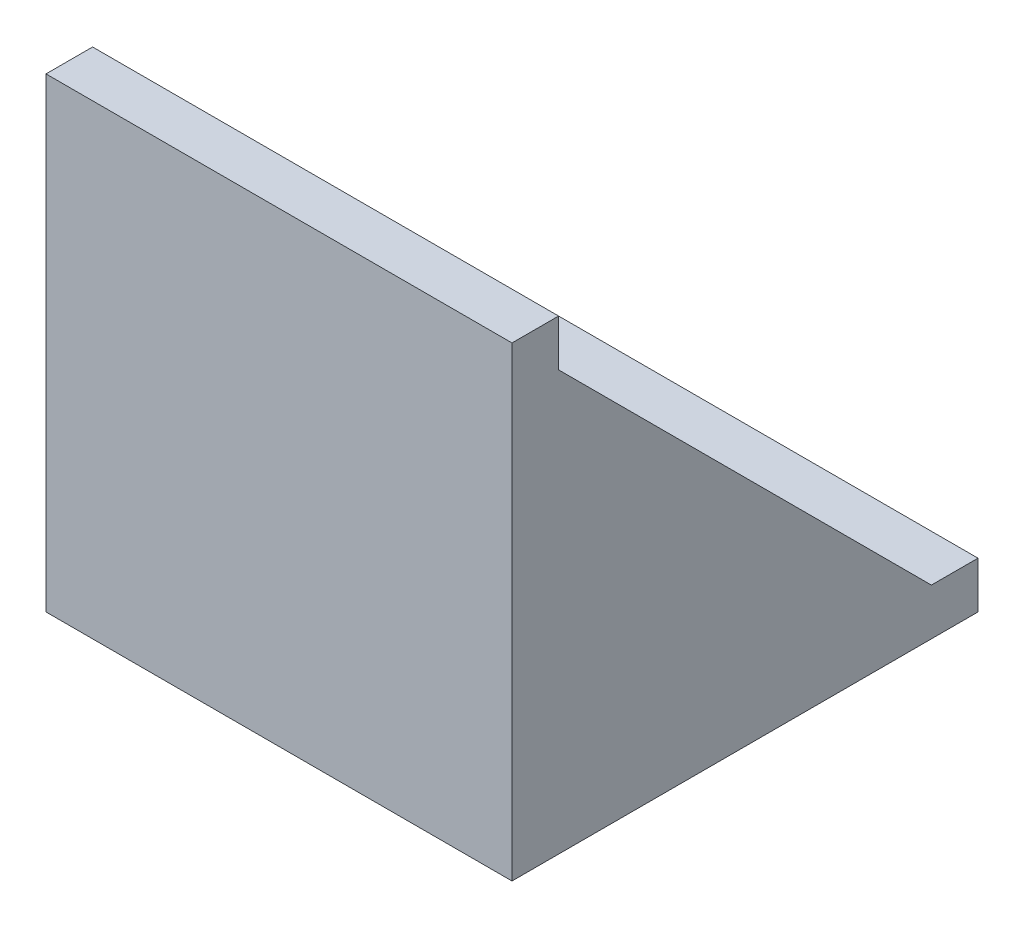
ISO-10303-21;
HEADER;
FILE_DESCRIPTION(('STEP AP214'),'2;1');
FILE_NAME('part.step','',(''),(''),'','','');
FILE_SCHEMA(('AUTOMOTIVE_DESIGN { 1 0 10303 214 1 1 1 1 }'));
ENDSEC;
DATA;
#1=APPLICATION_CONTEXT('core data for automotive mechanical design processes');
#2=APPLICATION_PROTOCOL_DEFINITION('international standard','automotive_design',2000,#1);
#3=PRODUCT_CONTEXT('',#1,'mechanical');
#4=PRODUCT('Part','Part','',(#3));
#5=PRODUCT_RELATED_PRODUCT_CATEGORY('part','',(#4));
#6=PRODUCT_DEFINITION_FORMATION('','',#4);
#7=PRODUCT_DEFINITION_CONTEXT('part definition',#1,'design');
#8=PRODUCT_DEFINITION('design','',#6,#7);
#9=PRODUCT_DEFINITION_SHAPE('','',#8);
#10=(LENGTH_UNIT() NAMED_UNIT(*) SI_UNIT(.MILLI.,.METRE.));
#11=(NAMED_UNIT(*) PLANE_ANGLE_UNIT() SI_UNIT($,.RADIAN.));
#12=(NAMED_UNIT(*) SI_UNIT($,.STERADIAN.) SOLID_ANGLE_UNIT());
#13=UNCERTAINTY_MEASURE_WITH_UNIT(LENGTH_MEASURE(1.E-05),#10,'distance_accuracy_value','');
#14=(GEOMETRIC_REPRESENTATION_CONTEXT(3) GLOBAL_UNCERTAINTY_ASSIGNED_CONTEXT((#13)) GLOBAL_UNIT_ASSIGNED_CONTEXT((#10,
#11,#12)) REPRESENTATION_CONTEXT('',''));
#15=CARTESIAN_POINT('',(0.,0.,0.));
#16=DIRECTION('',(0.,0.,1.));
#17=DIRECTION('',(1.,0.,0.));
#18=AXIS2_PLACEMENT_3D('',#15,#16,#17);
#19=CARTESIAN_POINT('',(20.,17.6554164227598,24.026925143299));
#20=DIRECTION('',(0.,-0.707106781186548,0.707106781186548));
#21=DIRECTION('',(0.,-0.707106781186548,-0.707106781186548));
#22=AXIS2_PLACEMENT_3D('',#19,#20,#21);
#23=PLANE('',#22);
#24=DIRECTION('',(-1.,0.,0.));
#25=VECTOR('',#24,1.);
#26=CARTESIAN_POINT('',(20.,1.65541642275984,8.02692514329899));
#27=LINE('',#26,#25);
#28=CARTESIAN_POINT('',(20.,1.65541642275984,8.02692514329899));
#29=VERTEX_POINT('',#28);
#30=CARTESIAN_POINT('',(19.,1.65541642275984,8.02692514329899));
#31=VERTEX_POINT('',#30);
#32=EDGE_CURVE('E121',#29,#31,#27,.T.);
#33=ORIENTED_EDGE('',*,*,#32,.T.);
#34=DIRECTION('',(0.,0.707106781186548,0.707106781186548));
#35=VECTOR('',#34,1.);
#36=CARTESIAN_POINT('',(19.,17.6554164227598,24.026925143299));
#37=LINE('',#36,#35);
#38=CARTESIAN_POINT('',(19.,17.6554164227598,24.026925143299));
#39=VERTEX_POINT('',#38);
#40=EDGE_CURVE('E11',#31,#39,#37,.T.);
#41=ORIENTED_EDGE('',*,*,#40,.T.);
#42=DIRECTION('',(-1.,0.,0.));
#43=VECTOR('',#42,1.);
#44=CARTESIAN_POINT('',(20.,17.6554164227598,24.026925143299));
#45=LINE('',#44,#43);
#46=CARTESIAN_POINT('',(20.,17.6554164227598,24.026925143299));
#47=VERTEX_POINT('',#46);
#48=EDGE_CURVE('E133',#47,#39,#45,.T.);
#49=ORIENTED_EDGE('',*,*,#48,.F.);
#50=DIRECTION('',(0.,0.707106781186548,0.707106781186548));
#51=VECTOR('',#50,1.);
#52=CARTESIAN_POINT('',(20.,17.6554164227598,24.026925143299));
#53=LINE('',#52,#51);
#54=EDGE_CURVE('E111',#29,#47,#53,.T.);
#55=ORIENTED_EDGE('',*,*,#54,.F.);
#56=EDGE_LOOP('',(#33,#41,#49,#55));
#57=FACE_BOUND('',#56,.T.);
#58=ADVANCED_FACE('F34',(#57),#23,.F.);
#59=CARTESIAN_POINT('',(20.,19.6554164227598,26.026925143299));
#60=DIRECTION('',(0.,-1.,0.));
#61=DIRECTION('',(0.,0.,-1.));
#62=AXIS2_PLACEMENT_3D('',#59,#60,#61);
#63=PLANE('',#62);
#64=DIRECTION('',(0.,0.,1.));
#65=VECTOR('',#64,1.);
#66=CARTESIAN_POINT('',(0.,19.6554164227598,26.026925143299));
#67=LINE('',#66,#65);
#68=CARTESIAN_POINT('',(0.,19.6554164227598,24.026925143299));
#69=VERTEX_POINT('',#68);
#70=CARTESIAN_POINT('',(0.,19.6554164227598,26.026925143299));
#71=VERTEX_POINT('',#70);
#72=EDGE_CURVE('E139',#69,#71,#67,.T.);
#73=ORIENTED_EDGE('',*,*,#72,.T.);
#74=DIRECTION('',(-1.,0.,0.));
#75=VECTOR('',#74,1.);
#76=CARTESIAN_POINT('',(20.,19.6554164227598,26.026925143299));
#77=LINE('',#76,#75);
#78=CARTESIAN_POINT('',(20.,19.6554164227598,26.026925143299));
#79=VERTEX_POINT('',#78);
#80=EDGE_CURVE('E166',#79,#71,#77,.T.);
#81=ORIENTED_EDGE('',*,*,#80,.F.);
#82=DIRECTION('',(0.,0.,1.));
#83=VECTOR('',#82,1.);
#84=CARTESIAN_POINT('',(20.,19.6554164227598,26.026925143299));
#85=LINE('',#84,#83);
#86=CARTESIAN_POINT('',(20.,19.6554164227598,24.026925143299));
#87=VERTEX_POINT('',#86);
#88=EDGE_CURVE('E155',#87,#79,#85,.T.);
#89=ORIENTED_EDGE('',*,*,#88,.F.);
#90=DIRECTION('',(-1.,0.,0.));
#91=VECTOR('',#90,1.);
#92=CARTESIAN_POINT('',(20.,19.6554164227598,24.026925143299));
#93=LINE('',#92,#91);
#94=EDGE_CURVE('E135',#87,#69,#93,.T.);
#95=ORIENTED_EDGE('',*,*,#94,.T.);
#96=EDGE_LOOP('',(#73,#81,#89,#95));
#97=FACE_BOUND('',#96,.T.);
#98=ADVANCED_FACE('F36',(#97),#63,.F.);
#99=CARTESIAN_POINT('',(20.,-0.344583577240157,26.026925143299));
#100=DIRECTION('',(0.,0.,-1.));
#101=DIRECTION('',(-1.,0.,0.));
#102=AXIS2_PLACEMENT_3D('',#99,#100,#101);
#103=PLANE('',#102);
#104=DIRECTION('',(0.,-1.,0.));
#105=VECTOR('',#104,1.);
#106=CARTESIAN_POINT('',(0.,-0.344583577240157,26.026925143299));
#107=LINE('',#106,#105);
#108=CARTESIAN_POINT('',(0.,-0.344583577240157,26.026925143299));
#109=VERTEX_POINT('',#108);
#110=EDGE_CURVE('E142',#71,#109,#107,.T.);
#111=ORIENTED_EDGE('',*,*,#110,.T.);
#112=DIRECTION('',(-1.,0.,0.));
#113=VECTOR('',#112,1.);
#114=CARTESIAN_POINT('',(20.,-0.344583577240157,26.026925143299));
#115=LINE('',#114,#113);
#116=CARTESIAN_POINT('',(20.,-0.344583577240157,26.026925143299));
#117=VERTEX_POINT('',#116);
#118=EDGE_CURVE('E163',#117,#109,#115,.T.);
#119=ORIENTED_EDGE('',*,*,#118,.F.);
#120=DIRECTION('',(0.,-1.,0.));
#121=VECTOR('',#120,1.);
#122=CARTESIAN_POINT('',(20.,-0.344583577240157,26.026925143299));
#123=LINE('',#122,#121);
#124=EDGE_CURVE('E94',#79,#117,#123,.T.);
#125=ORIENTED_EDGE('',*,*,#124,.F.);
#126=ORIENTED_EDGE('',*,*,#80,.T.);
#127=EDGE_LOOP('',(#111,#119,#125,#126));
#128=FACE_BOUND('',#127,.T.);
#129=ADVANCED_FACE('F220',(#128),#103,.F.);
#130=CARTESIAN_POINT('',(20.,-0.344583577240155,6.02692514329899));
#131=DIRECTION('',(0.,1.,0.));
#132=DIRECTION('',(0.,0.,1.));
#133=AXIS2_PLACEMENT_3D('',#130,#131,#132);
#134=PLANE('',#133);
#135=DIRECTION('',(0.,0.,-1.));
#136=VECTOR('',#135,1.);
#137=CARTESIAN_POINT('',(0.,-0.344583577240155,6.02692514329899));
#138=LINE('',#137,#136);
#139=CARTESIAN_POINT('',(0.,-0.344583577240155,6.02692514329899));
#140=VERTEX_POINT('',#139);
#141=EDGE_CURVE('E145',#109,#140,#138,.T.);
#142=ORIENTED_EDGE('',*,*,#141,.T.);
#143=DIRECTION('',(-1.,0.,0.));
#144=VECTOR('',#143,1.);
#145=CARTESIAN_POINT('',(20.,-0.344583577240155,6.02692514329899));
#146=LINE('',#145,#144);
#147=CARTESIAN_POINT('',(20.,-0.344583577240155,6.02692514329899));
#148=VERTEX_POINT('',#147);
#149=EDGE_CURVE('E160',#148,#140,#146,.T.);
#150=ORIENTED_EDGE('',*,*,#149,.F.);
#151=DIRECTION('',(0.,0.,-1.));
#152=VECTOR('',#151,1.);
#153=CARTESIAN_POINT('',(20.,-0.344583577240155,6.02692514329899));
#154=LINE('',#153,#152);
#155=EDGE_CURVE('E206',#117,#148,#154,.T.);
#156=ORIENTED_EDGE('',*,*,#155,.F.);
#157=ORIENTED_EDGE('',*,*,#118,.T.);
#158=EDGE_LOOP('',(#142,#150,#156,#157));
#159=FACE_BOUND('',#158,.T.);
#160=ADVANCED_FACE('F210',(#159),#134,.F.);
#161=CARTESIAN_POINT('',(20.,-0.344583577240155,6.02692514329899));
#162=DIRECTION('',(0.,0.,1.));
#163=DIRECTION('',(1.,0.,0.));
#164=AXIS2_PLACEMENT_3D('',#161,#162,#163);
#165=PLANE('',#164);
#166=DIRECTION('',(0.,1.,0.));
#167=VECTOR('',#166,1.);
#168=CARTESIAN_POINT('',(0.,-0.344583577240155,6.02692514329899));
#169=LINE('',#168,#167);
#170=CARTESIAN_POINT('',(0.,1.65541642275985,6.02692514329899));
#171=VERTEX_POINT('',#170);
#172=EDGE_CURVE('E147',#140,#171,#169,.T.);
#173=ORIENTED_EDGE('',*,*,#172,.T.);
#174=DIRECTION('',(-1.,0.,0.));
#175=VECTOR('',#174,1.);
#176=CARTESIAN_POINT('',(20.,1.65541642275985,6.02692514329899));
#177=LINE('',#176,#175);
#178=CARTESIAN_POINT('',(20.,1.65541642275985,6.02692514329899));
#179=VERTEX_POINT('',#178);
#180=EDGE_CURVE('E129',#179,#171,#177,.T.);
#181=ORIENTED_EDGE('',*,*,#180,.F.);
#182=DIRECTION('',(0.,1.,0.));
#183=VECTOR('',#182,1.);
#184=CARTESIAN_POINT('',(20.,-0.344583577240155,6.02692514329899));
#185=LINE('',#184,#183);
#186=EDGE_CURVE('E114',#148,#179,#185,.T.);
#187=ORIENTED_EDGE('',*,*,#186,.F.);
#188=ORIENTED_EDGE('',*,*,#149,.T.);
#189=EDGE_LOOP('',(#173,#181,#187,#188));
#190=FACE_BOUND('',#189,.T.);
#191=ADVANCED_FACE('F212',(#190),#165,.F.);
#192=CARTESIAN_POINT('',(20.,1.65541642275985,6.02692514329899));
#193=DIRECTION('',(0.,-1.,0.));
#194=DIRECTION('',(0.,0.,-1.));
#195=AXIS2_PLACEMENT_3D('',#192,#193,#194);
#196=PLANE('',#195);
#197=DIRECTION('',(0.,0.,1.));
#198=VECTOR('',#197,1.);
#199=CARTESIAN_POINT('',(0.,1.65541642275985,6.02692514329899));
#200=LINE('',#199,#198);
#201=CARTESIAN_POINT('',(0.,1.65541642275984,8.02692514329899));
#202=VERTEX_POINT('',#201);
#203=EDGE_CURVE('E149',#171,#202,#200,.T.);
#204=ORIENTED_EDGE('',*,*,#203,.T.);
#205=CARTESIAN_POINT('',(1.,1.65541642275984,8.02692514329899));
#206=VERTEX_POINT('',#205);
#207=EDGE_CURVE('E130',#206,#202,#27,.T.);
#208=ORIENTED_EDGE('',*,*,#207,.F.);
#209=DIRECTION('',(0.,0.,-1.));
#210=VECTOR('',#209,1.);
#211=CARTESIAN_POINT('',(1.,1.65541642275985,6.02692514329899));
#212=LINE('',#211,#210);
#213=CARTESIAN_POINT('',(1.,1.65541642275984,24.026925143299));
#214=VERTEX_POINT('',#213);
#215=EDGE_CURVE('E178',#214,#206,#212,.T.);
#216=ORIENTED_EDGE('',*,*,#215,.F.);
#217=DIRECTION('',(-1.,0.,0.));
#218=VECTOR('',#217,1.);
#219=CARTESIAN_POINT('',(20.,1.65541642275984,24.026925143299));
#220=LINE('',#219,#218);
#221=CARTESIAN_POINT('',(19.,1.65541642275984,24.026925143299));
#222=VERTEX_POINT('',#221);
#223=EDGE_CURVE('E199',#222,#214,#220,.T.);
#224=ORIENTED_EDGE('',*,*,#223,.F.);
#225=DIRECTION('',(0.,0.,1.));
#226=VECTOR('',#225,1.);
#227=CARTESIAN_POINT('',(19.,1.65541642275985,6.02692514329899));
#228=LINE('',#227,#226);
#229=EDGE_CURVE('E127',#31,#222,#228,.T.);
#230=ORIENTED_EDGE('',*,*,#229,.F.);
#231=ORIENTED_EDGE('',*,*,#32,.F.);
#232=DIRECTION('',(0.,0.,1.));
#233=VECTOR('',#232,1.);
#234=CARTESIAN_POINT('',(20.,1.65541642275985,6.02692514329899));
#235=LINE('',#234,#233);
#236=EDGE_CURVE('E107',#179,#29,#235,.T.);
#237=ORIENTED_EDGE('',*,*,#236,.F.);
#238=ORIENTED_EDGE('',*,*,#180,.T.);
#239=EDGE_LOOP('',(#204,#208,#216,#224,#230,#231,#237,#238));
#240=FACE_BOUND('',#239,.T.);
#241=ADVANCED_FACE('F123',(#240),#196,.F.);
#242=CARTESIAN_POINT('',(1.,17.6554164227598,24.026925143299));
#243=VERTEX_POINT('',#242);
#244=CARTESIAN_POINT('',(0.,17.6554164227598,24.026925143299));
#245=VERTEX_POINT('',#244);
#246=EDGE_CURVE('E157',#243,#245,#45,.T.);
#247=ORIENTED_EDGE('',*,*,#246,.F.);
#248=DIRECTION('',(0.,-0.707106781186548,-0.707106781186548));
#249=VECTOR('',#248,1.);
#250=CARTESIAN_POINT('',(1.,17.6554164227598,24.026925143299));
#251=LINE('',#250,#249);
#252=EDGE_CURVE('E42',#243,#206,#251,.T.);
#253=ORIENTED_EDGE('',*,*,#252,.T.);
#254=ORIENTED_EDGE('',*,*,#207,.T.);
#255=DIRECTION('',(0.,0.707106781186548,0.707106781186548));
#256=VECTOR('',#255,1.);
#257=CARTESIAN_POINT('',(0.,17.6554164227598,24.026925143299));
#258=LINE('',#257,#256);
#259=EDGE_CURVE('E151',#202,#245,#258,.T.);
#260=ORIENTED_EDGE('',*,*,#259,.T.);
#261=EDGE_LOOP('',(#247,#253,#254,#260));
#262=FACE_BOUND('',#261,.T.);
#263=ADVANCED_FACE('F172',(#262),#23,.F.);
#264=CARTESIAN_POINT('',(20.,17.6554164227598,24.026925143299));
#265=DIRECTION('',(0.,0.,1.));
#266=DIRECTION('',(1.,0.,0.));
#267=AXIS2_PLACEMENT_3D('',#264,#265,#266);
#268=PLANE('',#267);
#269=DIRECTION('',(0.,1.,0.));
#270=VECTOR('',#269,1.);
#271=CARTESIAN_POINT('',(0.,17.6554164227598,24.026925143299));
#272=LINE('',#271,#270);
#273=EDGE_CURVE('E85',#245,#69,#272,.T.);
#274=ORIENTED_EDGE('',*,*,#273,.T.);
#275=ORIENTED_EDGE('',*,*,#94,.F.);
#276=DIRECTION('',(0.,1.,0.));
#277=VECTOR('',#276,1.);
#278=CARTESIAN_POINT('',(20.,17.6554164227598,24.026925143299));
#279=LINE('',#278,#277);
#280=EDGE_CURVE('E58',#47,#87,#279,.T.);
#281=ORIENTED_EDGE('',*,*,#280,.F.);
#282=ORIENTED_EDGE('',*,*,#48,.T.);
#283=DIRECTION('',(0.,-1.,0.));
#284=VECTOR('',#283,1.);
#285=CARTESIAN_POINT('',(19.,17.6554164227598,24.026925143299));
#286=LINE('',#285,#284);
#287=EDGE_CURVE('E143',#39,#222,#286,.T.);
#288=ORIENTED_EDGE('',*,*,#287,.T.);
#289=ORIENTED_EDGE('',*,*,#223,.T.);
#290=DIRECTION('',(0.,-1.,0.));
#291=VECTOR('',#290,1.);
#292=CARTESIAN_POINT('',(1.,17.6554164227598,24.026925143299));
#293=LINE('',#292,#291);
#294=EDGE_CURVE('E49',#243,#214,#293,.T.);
#295=ORIENTED_EDGE('',*,*,#294,.F.);
#296=ORIENTED_EDGE('',*,*,#246,.T.);
#297=EDGE_LOOP('',(#274,#275,#281,#282,#288,#289,#295,#296));
#298=FACE_BOUND('',#297,.T.);
#299=ADVANCED_FACE('F189',(#298),#268,.F.);
#300=CARTESIAN_POINT('',(20.,0.,0.));
#301=DIRECTION('',(1.,0.,0.));
#302=DIRECTION('',(0.,0.,-1.));
#303=AXIS2_PLACEMENT_3D('',#300,#301,#302);
#304=PLANE('',#303);
#305=ORIENTED_EDGE('',*,*,#88,.T.);
#306=ORIENTED_EDGE('',*,*,#124,.T.);
#307=ORIENTED_EDGE('',*,*,#155,.T.);
#308=ORIENTED_EDGE('',*,*,#186,.T.);
#309=ORIENTED_EDGE('',*,*,#236,.T.);
#310=ORIENTED_EDGE('',*,*,#54,.T.);
#311=ORIENTED_EDGE('',*,*,#280,.T.);
#312=EDGE_LOOP('',(#305,#306,#307,#308,#309,#310,#311));
#313=FACE_BOUND('',#312,.T.);
#314=ADVANCED_FACE('F109',(#313),#304,.T.);
#315=CARTESIAN_POINT('',(0.,0.,0.));
#316=DIRECTION('',(1.,0.,0.));
#317=DIRECTION('',(0.,0.,-1.));
#318=AXIS2_PLACEMENT_3D('',#315,#316,#317);
#319=PLANE('',#318);
#320=ORIENTED_EDGE('',*,*,#72,.F.);
#321=ORIENTED_EDGE('',*,*,#273,.F.);
#322=ORIENTED_EDGE('',*,*,#259,.F.);
#323=ORIENTED_EDGE('',*,*,#203,.F.);
#324=ORIENTED_EDGE('',*,*,#172,.F.);
#325=ORIENTED_EDGE('',*,*,#141,.F.);
#326=ORIENTED_EDGE('',*,*,#110,.F.);
#327=EDGE_LOOP('',(#320,#321,#322,#323,#324,#325,#326));
#328=FACE_BOUND('',#327,.T.);
#329=ADVANCED_FACE('F184',(#328),#319,.F.);
#330=CARTESIAN_POINT('',(19.,17.6554164227598,6.02692514329899));
#331=DIRECTION('',(1.,0.,0.));
#332=DIRECTION('',(0.,0.,-1.));
#333=AXIS2_PLACEMENT_3D('',#330,#331,#332);
#334=PLANE('',#333);
#335=ORIENTED_EDGE('',*,*,#229,.T.);
#336=ORIENTED_EDGE('',*,*,#287,.F.);
#337=ORIENTED_EDGE('',*,*,#40,.F.);
#338=EDGE_LOOP('',(#335,#336,#337));
#339=FACE_BOUND('',#338,.T.);
#340=ADVANCED_FACE('F196',(#339),#334,.F.);
#341=CARTESIAN_POINT('',(1.,17.6554164227598,6.02692514329899));
#342=DIRECTION('',(-1.,0.,0.));
#343=DIRECTION('',(0.,0.,1.));
#344=AXIS2_PLACEMENT_3D('',#341,#342,#343);
#345=PLANE('',#344);
#346=ORIENTED_EDGE('',*,*,#294,.T.);
#347=ORIENTED_EDGE('',*,*,#215,.T.);
#348=ORIENTED_EDGE('',*,*,#252,.F.);
#349=EDGE_LOOP('',(#346,#347,#348));
#350=FACE_BOUND('',#349,.T.);
#351=ADVANCED_FACE('F239',(#350),#345,.F.);
#352=CLOSED_SHELL('',(#58,#98,#129,#160,#191,#241,#263,#299,#314,#329,#340,#351));
#353=MANIFOLD_SOLID_BREP('B2',#352);
#354=ADVANCED_BREP_SHAPE_REPRESENTATION('',(#18,#353),#14);
#355=SHAPE_DEFINITION_REPRESENTATION(#9,#354);
ENDSEC;
END-ISO-10303-21;
